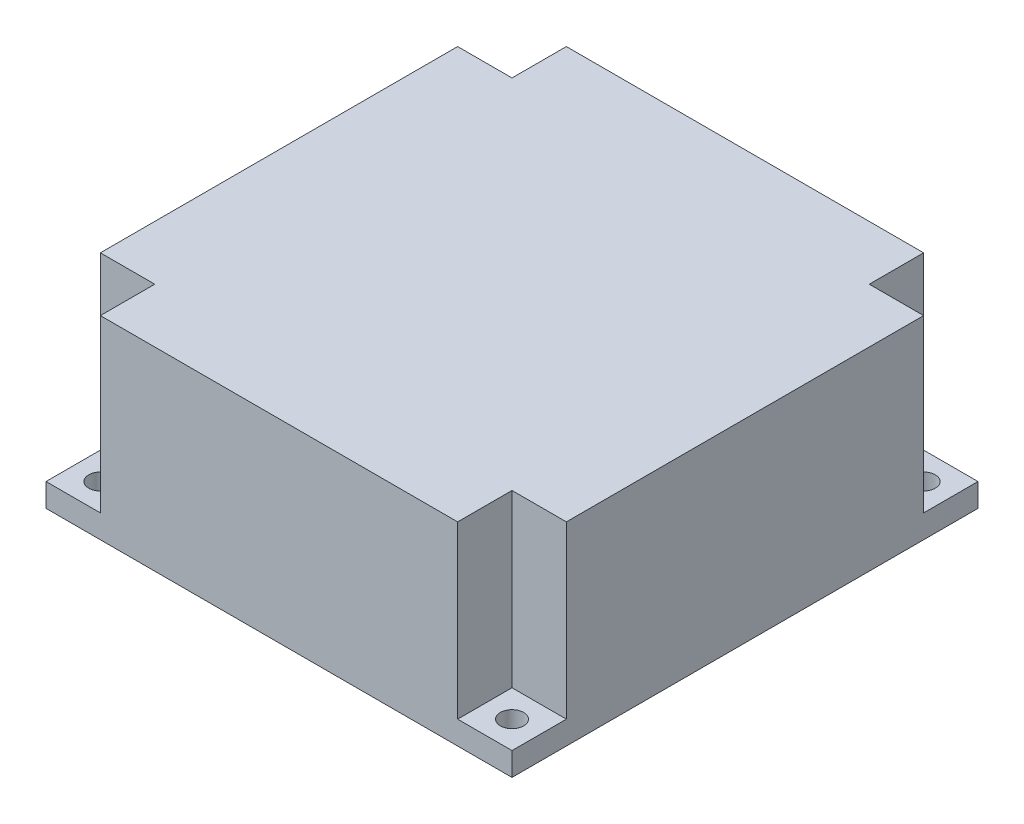
ISO-10303-21;
HEADER;
FILE_DESCRIPTION(('STEP AP214'),'2;1');
FILE_NAME('part.step','',(''),(''),'','','');
FILE_SCHEMA(('AUTOMOTIVE_DESIGN { 1 0 10303 214 1 1 1 1 }'));
ENDSEC;
DATA;
#1=APPLICATION_CONTEXT('core data for automotive mechanical design processes');
#2=APPLICATION_PROTOCOL_DEFINITION('international standard','automotive_design',2000,#1);
#3=PRODUCT_CONTEXT('',#1,'mechanical');
#4=PRODUCT('Part','Part','',(#3));
#5=PRODUCT_RELATED_PRODUCT_CATEGORY('part','',(#4));
#6=PRODUCT_DEFINITION_FORMATION('','',#4);
#7=PRODUCT_DEFINITION_CONTEXT('part definition',#1,'design');
#8=PRODUCT_DEFINITION('design','',#6,#7);
#9=PRODUCT_DEFINITION_SHAPE('','',#8);
#10=(LENGTH_UNIT() NAMED_UNIT(*) SI_UNIT(.MILLI.,.METRE.));
#11=(NAMED_UNIT(*) PLANE_ANGLE_UNIT() SI_UNIT($,.RADIAN.));
#12=(NAMED_UNIT(*) SI_UNIT($,.STERADIAN.) SOLID_ANGLE_UNIT());
#13=UNCERTAINTY_MEASURE_WITH_UNIT(LENGTH_MEASURE(1.E-05),#10,'distance_accuracy_value','');
#14=(GEOMETRIC_REPRESENTATION_CONTEXT(3) GLOBAL_UNCERTAINTY_ASSIGNED_CONTEXT((#13)) GLOBAL_UNIT_ASSIGNED_CONTEXT((#10,
#11,#12)) REPRESENTATION_CONTEXT('',''));
#15=CARTESIAN_POINT('',(0.,0.,0.));
#16=DIRECTION('',(0.,0.,1.));
#17=DIRECTION('',(1.,0.,0.));
#18=AXIS2_PLACEMENT_3D('',#15,#16,#17);
#19=CARTESIAN_POINT('',(0.,3.,0.));
#20=DIRECTION('',(0.,-1.,0.));
#21=DIRECTION('',(0.,0.,-1.));
#22=AXIS2_PLACEMENT_3D('',#19,#20,#21);
#23=PLANE('',#22);
#24=CARTESIAN_POINT('',(56.4999999999999,3.,-56.5));
#25=DIRECTION('',(0.,1.,0.));
#26=DIRECTION('',(0.,0.,1.));
#27=AXIS2_PLACEMENT_3D('',#24,#25,#26);
#28=CIRCLE('',#27,1.5);
#29=CARTESIAN_POINT('',(56.4999999999999,3.,-55.));
#30=VERTEX_POINT('',#29);
#31=EDGE_CURVE('E185',#30,#30,#28,.T.);
#32=ORIENTED_EDGE('',*,*,#31,.F.);
#33=EDGE_LOOP('',(#32));
#34=FACE_BOUND('',#33,.T.);
#35=DIRECTION('',(0.,0.,-1.));
#36=VECTOR('',#35,1.);
#37=CARTESIAN_POINT('',(53.,3.,-60.));
#38=LINE('',#37,#36);
#39=CARTESIAN_POINT('',(53.,3.,-53.));
#40=VERTEX_POINT('',#39);
#41=CARTESIAN_POINT('',(53.,3.,-60.));
#42=VERTEX_POINT('',#41);
#43=EDGE_CURVE('E49',#40,#42,#38,.T.);
#44=ORIENTED_EDGE('',*,*,#43,.F.);
#45=DIRECTION('',(-1.,0.,0.));
#46=VECTOR('',#45,1.);
#47=CARTESIAN_POINT('',(60.,3.,-53.));
#48=LINE('',#47,#46);
#49=CARTESIAN_POINT('',(60.,3.,-53.));
#50=VERTEX_POINT('',#49);
#51=EDGE_CURVE('E325',#50,#40,#48,.T.);
#52=ORIENTED_EDGE('',*,*,#51,.F.);
#53=DIRECTION('',(0.,0.,-1.));
#54=VECTOR('',#53,1.);
#55=CARTESIAN_POINT('',(60.,3.,0.));
#56=LINE('',#55,#54);
#57=CARTESIAN_POINT('',(60.,3.,-60.));
#58=VERTEX_POINT('',#57);
#59=EDGE_CURVE('E240',#50,#58,#56,.T.);
#60=ORIENTED_EDGE('',*,*,#59,.T.);
#61=DIRECTION('',(-1.,0.,0.));
#62=VECTOR('',#61,1.);
#63=CARTESIAN_POINT('',(0.,3.,-60.));
#64=LINE('',#63,#62);
#65=EDGE_CURVE('E223',#58,#42,#64,.T.);
#66=ORIENTED_EDGE('',*,*,#65,.T.);
#67=EDGE_LOOP('',(#44,#52,#60,#66));
#68=FACE_BOUND('',#67,.T.);
#69=ADVANCED_FACE('F32',(#34,#68),#23,.F.);
#70=CARTESIAN_POINT('',(56.5000000000001,3.,-3.5));
#71=DIRECTION('',(0.,1.,0.));
#72=DIRECTION('',(0.,0.,1.));
#73=AXIS2_PLACEMENT_3D('',#70,#71,#72);
#74=CIRCLE('',#73,1.5);
#75=CARTESIAN_POINT('',(56.5000000000001,3.,-2.));
#76=VERTEX_POINT('',#75);
#77=EDGE_CURVE('E191',#76,#76,#74,.T.);
#78=ORIENTED_EDGE('',*,*,#77,.F.);
#79=EDGE_LOOP('',(#78));
#80=FACE_BOUND('',#79,.T.);
#81=DIRECTION('',(1.,0.,0.));
#82=VECTOR('',#81,1.);
#83=CARTESIAN_POINT('',(60.,3.,-7.));
#84=LINE('',#83,#82);
#85=CARTESIAN_POINT('',(53.,3.,-7.));
#86=VERTEX_POINT('',#85);
#87=CARTESIAN_POINT('',(60.,3.,-7.));
#88=VERTEX_POINT('',#87);
#89=EDGE_CURVE('E57',#86,#88,#84,.T.);
#90=ORIENTED_EDGE('',*,*,#89,.F.);
#91=DIRECTION('',(0.,0.,-1.));
#92=VECTOR('',#91,1.);
#93=CARTESIAN_POINT('',(53.,3.,-7.));
#94=LINE('',#93,#92);
#95=CARTESIAN_POINT('',(53.,3.,0.));
#96=VERTEX_POINT('',#95);
#97=EDGE_CURVE('E263',#96,#86,#94,.T.);
#98=ORIENTED_EDGE('',*,*,#97,.F.);
#99=DIRECTION('',(1.,0.,0.));
#100=VECTOR('',#99,1.);
#101=CARTESIAN_POINT('',(0.,3.,0.));
#102=LINE('',#101,#100);
#103=CARTESIAN_POINT('',(60.,3.,0.));
#104=VERTEX_POINT('',#103);
#105=EDGE_CURVE('E213',#96,#104,#102,.T.);
#106=ORIENTED_EDGE('',*,*,#105,.T.);
#107=EDGE_CURVE('E242',#104,#88,#56,.T.);
#108=ORIENTED_EDGE('',*,*,#107,.T.);
#109=EDGE_LOOP('',(#90,#98,#106,#108));
#110=FACE_BOUND('',#109,.T.);
#111=ADVANCED_FACE('F380',(#80,#110),#23,.F.);
#112=CARTESIAN_POINT('',(3.50000000000009,3.,-3.5));
#113=DIRECTION('',(0.,1.,0.));
#114=DIRECTION('',(0.,0.,1.));
#115=AXIS2_PLACEMENT_3D('',#112,#113,#114);
#116=CIRCLE('',#115,1.5);
#117=CARTESIAN_POINT('',(3.50000000000009,3.,-2.));
#118=VERTEX_POINT('',#117);
#119=EDGE_CURVE('E197',#118,#118,#116,.T.);
#120=ORIENTED_EDGE('',*,*,#119,.F.);
#121=EDGE_LOOP('',(#120));
#122=FACE_BOUND('',#121,.T.);
#123=DIRECTION('',(0.,0.,1.));
#124=VECTOR('',#123,1.);
#125=CARTESIAN_POINT('',(7.00000000000001,3.,-6.99999999999999));
#126=LINE('',#125,#124);
#127=CARTESIAN_POINT('',(7.00000000000001,3.,-6.99999999999999));
#128=VERTEX_POINT('',#127);
#129=CARTESIAN_POINT('',(7.,3.,0.));
#130=VERTEX_POINT('',#129);
#131=EDGE_CURVE('E249',#128,#130,#126,.T.);
#132=ORIENTED_EDGE('',*,*,#131,.F.);
#133=DIRECTION('',(1.,0.,0.));
#134=VECTOR('',#133,1.);
#135=CARTESIAN_POINT('',(7.00000000000001,3.,-6.99999999999999));
#136=LINE('',#135,#134);
#137=CARTESIAN_POINT('',(0.,3.,-6.99999999999999));
#138=VERTEX_POINT('',#137);
#139=EDGE_CURVE('E264',#138,#128,#136,.T.);
#140=ORIENTED_EDGE('',*,*,#139,.F.);
#141=DIRECTION('',(0.,0.,1.));
#142=VECTOR('',#141,1.);
#143=CARTESIAN_POINT('',(0.,3.,0.));
#144=LINE('',#143,#142);
#145=CARTESIAN_POINT('',(0.,3.,0.));
#146=VERTEX_POINT('',#145);
#147=EDGE_CURVE('E209',#138,#146,#144,.T.);
#148=ORIENTED_EDGE('',*,*,#147,.T.);
#149=EDGE_CURVE('E243',#146,#130,#102,.T.);
#150=ORIENTED_EDGE('',*,*,#149,.T.);
#151=EDGE_LOOP('',(#132,#140,#148,#150));
#152=FACE_BOUND('',#151,.T.);
#153=ADVANCED_FACE('F248',(#122,#152),#23,.F.);
#154=CARTESIAN_POINT('',(3.49999999999991,3.,-56.5));
#155=DIRECTION('',(0.,1.,0.));
#156=DIRECTION('',(0.,0.,1.));
#157=AXIS2_PLACEMENT_3D('',#154,#155,#156);
#158=CIRCLE('',#157,1.5);
#159=CARTESIAN_POINT('',(3.49999999999991,3.,-55.));
#160=VERTEX_POINT('',#159);
#161=EDGE_CURVE('E174',#160,#160,#158,.T.);
#162=ORIENTED_EDGE('',*,*,#161,.F.);
#163=EDGE_LOOP('',(#162));
#164=FACE_BOUND('',#163,.T.);
#165=DIRECTION('',(0.,0.,1.));
#166=VECTOR('',#165,1.);
#167=CARTESIAN_POINT('',(7.,3.,-60.));
#168=LINE('',#167,#166);
#169=CARTESIAN_POINT('',(7.,3.,-60.));
#170=VERTEX_POINT('',#169);
#171=CARTESIAN_POINT('',(7.00000000000001,3.,-53.));
#172=VERTEX_POINT('',#171);
#173=EDGE_CURVE('E170',#170,#172,#168,.T.);
#174=ORIENTED_EDGE('',*,*,#173,.F.);
#175=CARTESIAN_POINT('',(0.,3.,-60.));
#176=VERTEX_POINT('',#175);
#177=EDGE_CURVE('E236',#170,#176,#64,.T.);
#178=ORIENTED_EDGE('',*,*,#177,.T.);
#179=CARTESIAN_POINT('',(0.,3.,-53.));
#180=VERTEX_POINT('',#179);
#181=EDGE_CURVE('E212',#176,#180,#144,.T.);
#182=ORIENTED_EDGE('',*,*,#181,.T.);
#183=DIRECTION('',(-1.,0.,0.));
#184=VECTOR('',#183,1.);
#185=CARTESIAN_POINT('',(7.00000000000001,3.,-53.));
#186=LINE('',#185,#184);
#187=EDGE_CURVE('E280',#172,#180,#186,.T.);
#188=ORIENTED_EDGE('',*,*,#187,.F.);
#189=EDGE_LOOP('',(#174,#178,#182,#188));
#190=FACE_BOUND('',#189,.T.);
#191=ADVANCED_FACE('F309',(#164,#190),#23,.F.);
#192=CARTESIAN_POINT('',(0.,0.,0.));
#193=DIRECTION('',(0.,-1.,0.));
#194=DIRECTION('',(0.,0.,-1.));
#195=AXIS2_PLACEMENT_3D('',#192,#193,#194);
#196=PLANE('',#195);
#197=CARTESIAN_POINT('',(56.4999999999999,0.,-56.5));
#198=DIRECTION('',(0.,1.,0.));
#199=DIRECTION('',(0.,0.,1.));
#200=AXIS2_PLACEMENT_3D('',#197,#198,#199);
#201=CIRCLE('',#200,1.5);
#202=CARTESIAN_POINT('',(56.4999999999999,0.,-55.));
#203=VERTEX_POINT('',#202);
#204=EDGE_CURVE('E183',#203,#203,#201,.T.);
#205=ORIENTED_EDGE('',*,*,#204,.T.);
#206=EDGE_LOOP('',(#205));
#207=FACE_BOUND('',#206,.T.);
#208=CARTESIAN_POINT('',(3.50000000000009,0.,-3.5));
#209=DIRECTION('',(0.,1.,0.));
#210=DIRECTION('',(0.,0.,1.));
#211=AXIS2_PLACEMENT_3D('',#208,#209,#210);
#212=CIRCLE('',#211,1.5);
#213=CARTESIAN_POINT('',(3.50000000000009,0.,-2.));
#214=VERTEX_POINT('',#213);
#215=EDGE_CURVE('E194',#214,#214,#212,.T.);
#216=ORIENTED_EDGE('',*,*,#215,.T.);
#217=EDGE_LOOP('',(#216));
#218=FACE_BOUND('',#217,.T.);
#219=DIRECTION('',(0.,0.,1.));
#220=VECTOR('',#219,1.);
#221=CARTESIAN_POINT('',(0.,0.,0.));
#222=LINE('',#221,#220);
#223=CARTESIAN_POINT('',(0.,0.,-60.));
#224=VERTEX_POINT('',#223);
#225=CARTESIAN_POINT('',(0.,0.,0.));
#226=VERTEX_POINT('',#225);
#227=EDGE_CURVE('E200',#224,#226,#222,.T.);
#228=ORIENTED_EDGE('',*,*,#227,.F.);
#229=DIRECTION('',(-1.,0.,0.));
#230=VECTOR('',#229,1.);
#231=CARTESIAN_POINT('',(0.,0.,-60.));
#232=LINE('',#231,#230);
#233=CARTESIAN_POINT('',(60.,0.,-60.));
#234=VERTEX_POINT('',#233);
#235=EDGE_CURVE('E224',#234,#224,#232,.T.);
#236=ORIENTED_EDGE('',*,*,#235,.F.);
#237=DIRECTION('',(0.,0.,-1.));
#238=VECTOR('',#237,1.);
#239=CARTESIAN_POINT('',(60.,0.,0.));
#240=LINE('',#239,#238);
#241=CARTESIAN_POINT('',(60.,0.,0.));
#242=VERTEX_POINT('',#241);
#243=EDGE_CURVE('E226',#242,#234,#240,.T.);
#244=ORIENTED_EDGE('',*,*,#243,.F.);
#245=DIRECTION('',(1.,0.,0.));
#246=VECTOR('',#245,1.);
#247=CARTESIAN_POINT('',(0.,0.,0.));
#248=LINE('',#247,#246);
#249=EDGE_CURVE('E228',#226,#242,#248,.T.);
#250=ORIENTED_EDGE('',*,*,#249,.F.);
#251=EDGE_LOOP('',(#228,#236,#244,#250));
#252=FACE_BOUND('',#251,.T.);
#253=CARTESIAN_POINT('',(56.5000000000001,0.,-3.5));
#254=DIRECTION('',(0.,1.,0.));
#255=DIRECTION('',(0.,0.,1.));
#256=AXIS2_PLACEMENT_3D('',#253,#254,#255);
#257=CIRCLE('',#256,1.5);
#258=CARTESIAN_POINT('',(56.5000000000001,0.,-2.));
#259=VERTEX_POINT('',#258);
#260=EDGE_CURVE('E188',#259,#259,#257,.T.);
#261=ORIENTED_EDGE('',*,*,#260,.T.);
#262=EDGE_LOOP('',(#261));
#263=FACE_BOUND('',#262,.T.);
#264=CARTESIAN_POINT('',(3.49999999999991,0.,-56.5));
#265=DIRECTION('',(0.,1.,0.));
#266=DIRECTION('',(0.,0.,1.));
#267=AXIS2_PLACEMENT_3D('',#264,#265,#266);
#268=CIRCLE('',#267,1.5);
#269=CARTESIAN_POINT('',(3.49999999999991,0.,-55.));
#270=VERTEX_POINT('',#269);
#271=EDGE_CURVE('E171',#270,#270,#268,.T.);
#272=ORIENTED_EDGE('',*,*,#271,.T.);
#273=EDGE_LOOP('',(#272));
#274=FACE_BOUND('',#273,.T.);
#275=ADVANCED_FACE('F300',(#207,#218,#252,#263,#274),#196,.T.);
#276=CARTESIAN_POINT('',(0.,3.,0.));
#277=DIRECTION('',(1.,0.,0.));
#278=DIRECTION('',(0.,0.,-1.));
#279=AXIS2_PLACEMENT_3D('',#276,#277,#278);
#280=PLANE('',#279);
#281=ORIENTED_EDGE('',*,*,#227,.T.);
#282=DIRECTION('',(0.,-1.,0.));
#283=VECTOR('',#282,1.);
#284=CARTESIAN_POINT('',(0.,3.,0.));
#285=LINE('',#284,#283);
#286=EDGE_CURVE('E11',#146,#226,#285,.T.);
#287=ORIENTED_EDGE('',*,*,#286,.F.);
#288=ORIENTED_EDGE('',*,*,#147,.F.);
#289=DIRECTION('',(0.,-1.,0.));
#290=VECTOR('',#289,1.);
#291=CARTESIAN_POINT('',(0.,25.,-6.99999999999999));
#292=LINE('',#291,#290);
#293=CARTESIAN_POINT('',(0.,25.,-6.99999999999999));
#294=VERTEX_POINT('',#293);
#295=EDGE_CURVE('E176',#294,#138,#292,.T.);
#296=ORIENTED_EDGE('',*,*,#295,.F.);
#297=DIRECTION('',(0.,0.,1.));
#298=VECTOR('',#297,1.);
#299=CARTESIAN_POINT('',(0.,25.,-53.));
#300=LINE('',#299,#298);
#301=CARTESIAN_POINT('',(0.,25.,-53.));
#302=VERTEX_POINT('',#301);
#303=EDGE_CURVE('E158',#302,#294,#300,.T.);
#304=ORIENTED_EDGE('',*,*,#303,.F.);
#305=DIRECTION('',(0.,-1.,0.));
#306=VECTOR('',#305,1.);
#307=CARTESIAN_POINT('',(0.,25.,-53.));
#308=LINE('',#307,#306);
#309=EDGE_CURVE('E155',#302,#180,#308,.T.);
#310=ORIENTED_EDGE('',*,*,#309,.T.);
#311=ORIENTED_EDGE('',*,*,#181,.F.);
#312=DIRECTION('',(0.,-1.,0.));
#313=VECTOR('',#312,1.);
#314=CARTESIAN_POINT('',(0.,3.,-60.));
#315=LINE('',#314,#313);
#316=EDGE_CURVE('E220',#176,#224,#315,.T.);
#317=ORIENTED_EDGE('',*,*,#316,.T.);
#318=EDGE_LOOP('',(#281,#287,#288,#296,#304,#310,#311,#317));
#319=FACE_BOUND('',#318,.T.);
#320=ADVANCED_FACE('F34',(#319),#280,.F.);
#321=CARTESIAN_POINT('',(0.,3.,0.));
#322=DIRECTION('',(0.,0.,-1.));
#323=DIRECTION('',(-1.,0.,0.));
#324=AXIS2_PLACEMENT_3D('',#321,#322,#323);
#325=PLANE('',#324);
#326=ORIENTED_EDGE('',*,*,#249,.T.);
#327=DIRECTION('',(0.,-1.,0.));
#328=VECTOR('',#327,1.);
#329=CARTESIAN_POINT('',(60.,3.,0.));
#330=LINE('',#329,#328);
#331=EDGE_CURVE('E41',#104,#242,#330,.T.);
#332=ORIENTED_EDGE('',*,*,#331,.F.);
#333=ORIENTED_EDGE('',*,*,#105,.F.);
#334=DIRECTION('',(0.,-1.,0.));
#335=VECTOR('',#334,1.);
#336=CARTESIAN_POINT('',(53.,25.,0.));
#337=LINE('',#336,#335);
#338=CARTESIAN_POINT('',(53.,25.,0.));
#339=VERTEX_POINT('',#338);
#340=EDGE_CURVE('E269',#339,#96,#337,.T.);
#341=ORIENTED_EDGE('',*,*,#340,.F.);
#342=DIRECTION('',(1.,0.,0.));
#343=VECTOR('',#342,1.);
#344=CARTESIAN_POINT('',(7.00000000000001,25.,0.));
#345=LINE('',#344,#343);
#346=CARTESIAN_POINT('',(7.00000000000001,25.,0.));
#347=VERTEX_POINT('',#346);
#348=EDGE_CURVE('E268',#347,#339,#345,.T.);
#349=ORIENTED_EDGE('',*,*,#348,.F.);
#350=DIRECTION('',(0.,-1.,0.));
#351=VECTOR('',#350,1.);
#352=CARTESIAN_POINT('',(7.00000000000001,25.,0.));
#353=LINE('',#352,#351);
#354=EDGE_CURVE('E260',#347,#130,#353,.T.);
#355=ORIENTED_EDGE('',*,*,#354,.T.);
#356=ORIENTED_EDGE('',*,*,#149,.F.);
#357=ORIENTED_EDGE('',*,*,#286,.T.);
#358=EDGE_LOOP('',(#326,#332,#333,#341,#349,#355,#356,#357));
#359=FACE_BOUND('',#358,.T.);
#360=ADVANCED_FACE('F266',(#359),#325,.F.);
#361=CARTESIAN_POINT('',(60.,3.,0.));
#362=DIRECTION('',(-1.,0.,0.));
#363=DIRECTION('',(0.,0.,1.));
#364=AXIS2_PLACEMENT_3D('',#361,#362,#363);
#365=PLANE('',#364);
#366=ORIENTED_EDGE('',*,*,#243,.T.);
#367=DIRECTION('',(0.,-1.,0.));
#368=VECTOR('',#367,1.);
#369=CARTESIAN_POINT('',(60.,3.,-60.));
#370=LINE('',#369,#368);
#371=EDGE_CURVE('E217',#58,#234,#370,.T.);
#372=ORIENTED_EDGE('',*,*,#371,.F.);
#373=ORIENTED_EDGE('',*,*,#59,.F.);
#374=DIRECTION('',(0.,-1.,0.));
#375=VECTOR('',#374,1.);
#376=CARTESIAN_POINT('',(60.,25.,-53.));
#377=LINE('',#376,#375);
#378=CARTESIAN_POINT('',(60.,25.,-53.));
#379=VERTEX_POINT('',#378);
#380=EDGE_CURVE('E330',#379,#50,#377,.T.);
#381=ORIENTED_EDGE('',*,*,#380,.F.);
#382=DIRECTION('',(0.,0.,-1.));
#383=VECTOR('',#382,1.);
#384=CARTESIAN_POINT('',(60.,25.,-53.));
#385=LINE('',#384,#383);
#386=CARTESIAN_POINT('',(60.,25.,-7.));
#387=VERTEX_POINT('',#386);
#388=EDGE_CURVE('E369',#387,#379,#385,.T.);
#389=ORIENTED_EDGE('',*,*,#388,.F.);
#390=DIRECTION('',(0.,-1.,0.));
#391=VECTOR('',#390,1.);
#392=CARTESIAN_POINT('',(60.,25.,-7.));
#393=LINE('',#392,#391);
#394=EDGE_CURVE('E328',#387,#88,#393,.T.);
#395=ORIENTED_EDGE('',*,*,#394,.T.);
#396=ORIENTED_EDGE('',*,*,#107,.F.);
#397=ORIENTED_EDGE('',*,*,#331,.T.);
#398=EDGE_LOOP('',(#366,#372,#373,#381,#389,#395,#396,#397));
#399=FACE_BOUND('',#398,.T.);
#400=ADVANCED_FACE('F296',(#399),#365,.F.);
#401=CARTESIAN_POINT('',(0.,3.,-60.));
#402=DIRECTION('',(0.,0.,1.));
#403=DIRECTION('',(1.,0.,0.));
#404=AXIS2_PLACEMENT_3D('',#401,#402,#403);
#405=PLANE('',#404);
#406=ORIENTED_EDGE('',*,*,#235,.T.);
#407=ORIENTED_EDGE('',*,*,#316,.F.);
#408=ORIENTED_EDGE('',*,*,#177,.F.);
#409=DIRECTION('',(0.,-1.,0.));
#410=VECTOR('',#409,1.);
#411=CARTESIAN_POINT('',(7.,25.,-60.));
#412=LINE('',#411,#410);
#413=CARTESIAN_POINT('',(7.,25.,-60.));
#414=VERTEX_POINT('',#413);
#415=EDGE_CURVE('E354',#414,#170,#412,.T.);
#416=ORIENTED_EDGE('',*,*,#415,.F.);
#417=DIRECTION('',(-1.,0.,0.));
#418=VECTOR('',#417,1.);
#419=CARTESIAN_POINT('',(7.,25.,-60.));
#420=LINE('',#419,#418);
#421=CARTESIAN_POINT('',(53.,25.,-60.));
#422=VERTEX_POINT('',#421);
#423=EDGE_CURVE('E164',#422,#414,#420,.T.);
#424=ORIENTED_EDGE('',*,*,#423,.F.);
#425=DIRECTION('',(0.,-1.,0.));
#426=VECTOR('',#425,1.);
#427=CARTESIAN_POINT('',(53.,25.,-60.));
#428=LINE('',#427,#426);
#429=EDGE_CURVE('E348',#422,#42,#428,.T.);
#430=ORIENTED_EDGE('',*,*,#429,.T.);
#431=ORIENTED_EDGE('',*,*,#65,.F.);
#432=ORIENTED_EDGE('',*,*,#371,.T.);
#433=EDGE_LOOP('',(#406,#407,#408,#416,#424,#430,#431,#432));
#434=FACE_BOUND('',#433,.T.);
#435=ADVANCED_FACE('F304',(#434),#405,.F.);
#436=CARTESIAN_POINT('',(3.50000000000009,3.,-3.5));
#437=DIRECTION('',(0.,-1.,0.));
#438=DIRECTION('',(0.,0.,-1.));
#439=AXIS2_PLACEMENT_3D('',#436,#437,#438);
#440=CYLINDRICAL_SURFACE('',#439,1.5);
#441=ORIENTED_EDGE('',*,*,#119,.T.);
#442=EDGE_LOOP('',(#441));
#443=FACE_BOUND('',#442,.T.);
#444=ORIENTED_EDGE('',*,*,#215,.F.);
#445=EDGE_LOOP('',(#444));
#446=FACE_BOUND('',#445,.T.);
#447=ADVANCED_FACE('F393',(#443,#446),#440,.F.);
#448=CARTESIAN_POINT('',(56.5000000000001,3.,-3.5));
#449=DIRECTION('',(0.,-1.,0.));
#450=DIRECTION('',(0.,0.,-1.));
#451=AXIS2_PLACEMENT_3D('',#448,#449,#450);
#452=CYLINDRICAL_SURFACE('',#451,1.5);
#453=ORIENTED_EDGE('',*,*,#77,.T.);
#454=EDGE_LOOP('',(#453));
#455=FACE_BOUND('',#454,.T.);
#456=ORIENTED_EDGE('',*,*,#260,.F.);
#457=EDGE_LOOP('',(#456));
#458=FACE_BOUND('',#457,.T.);
#459=ADVANCED_FACE('F443',(#455,#458),#452,.F.);
#460=CARTESIAN_POINT('',(56.4999999999999,3.,-56.5));
#461=DIRECTION('',(0.,-1.,0.));
#462=DIRECTION('',(0.,0.,-1.));
#463=AXIS2_PLACEMENT_3D('',#460,#461,#462);
#464=CYLINDRICAL_SURFACE('',#463,1.5);
#465=ORIENTED_EDGE('',*,*,#31,.T.);
#466=EDGE_LOOP('',(#465));
#467=FACE_BOUND('',#466,.T.);
#468=ORIENTED_EDGE('',*,*,#204,.F.);
#469=EDGE_LOOP('',(#468));
#470=FACE_BOUND('',#469,.T.);
#471=ADVANCED_FACE('F436',(#467,#470),#464,.F.);
#472=CARTESIAN_POINT('',(3.49999999999991,3.,-56.5));
#473=DIRECTION('',(0.,-1.,0.));
#474=DIRECTION('',(0.,0.,-1.));
#475=AXIS2_PLACEMENT_3D('',#472,#473,#474);
#476=CYLINDRICAL_SURFACE('',#475,1.5);
#477=ORIENTED_EDGE('',*,*,#161,.T.);
#478=EDGE_LOOP('',(#477));
#479=FACE_BOUND('',#478,.T.);
#480=ORIENTED_EDGE('',*,*,#271,.F.);
#481=EDGE_LOOP('',(#480));
#482=FACE_BOUND('',#481,.T.);
#483=ADVANCED_FACE('F432',(#479,#482),#476,.F.);
#484=CARTESIAN_POINT('',(7.,25.,-60.));
#485=DIRECTION('',(1.,0.,0.));
#486=DIRECTION('',(0.,0.,-1.));
#487=AXIS2_PLACEMENT_3D('',#484,#485,#486);
#488=PLANE('',#487);
#489=ORIENTED_EDGE('',*,*,#173,.T.);
#490=DIRECTION('',(0.,-1.,0.));
#491=VECTOR('',#490,1.);
#492=CARTESIAN_POINT('',(7.00000000000001,25.,-53.));
#493=LINE('',#492,#491);
#494=CARTESIAN_POINT('',(7.00000000000001,25.,-53.));
#495=VERTEX_POINT('',#494);
#496=EDGE_CURVE('E152',#495,#172,#493,.T.);
#497=ORIENTED_EDGE('',*,*,#496,.F.);
#498=DIRECTION('',(0.,0.,1.));
#499=VECTOR('',#498,1.);
#500=CARTESIAN_POINT('',(7.,25.,-60.));
#501=LINE('',#500,#499);
#502=EDGE_CURVE('E159',#414,#495,#501,.T.);
#503=ORIENTED_EDGE('',*,*,#502,.F.);
#504=ORIENTED_EDGE('',*,*,#415,.T.);
#505=EDGE_LOOP('',(#489,#497,#503,#504));
#506=FACE_BOUND('',#505,.T.);
#507=ADVANCED_FACE('F169',(#506),#488,.F.);
#508=CARTESIAN_POINT('',(7.00000000000001,25.,-53.));
#509=DIRECTION('',(0.,0.,1.));
#510=DIRECTION('',(1.,0.,0.));
#511=AXIS2_PLACEMENT_3D('',#508,#509,#510);
#512=PLANE('',#511);
#513=ORIENTED_EDGE('',*,*,#187,.T.);
#514=ORIENTED_EDGE('',*,*,#309,.F.);
#515=DIRECTION('',(-1.,0.,0.));
#516=VECTOR('',#515,1.);
#517=CARTESIAN_POINT('',(7.00000000000001,25.,-53.));
#518=LINE('',#517,#516);
#519=EDGE_CURVE('E147',#495,#302,#518,.T.);
#520=ORIENTED_EDGE('',*,*,#519,.F.);
#521=ORIENTED_EDGE('',*,*,#496,.T.);
#522=EDGE_LOOP('',(#513,#514,#520,#521));
#523=FACE_BOUND('',#522,.T.);
#524=ADVANCED_FACE('F150',(#523),#512,.F.);
#525=CARTESIAN_POINT('',(7.00000000000001,25.,-6.99999999999999));
#526=DIRECTION('',(0.,0.,-1.));
#527=DIRECTION('',(-1.,0.,0.));
#528=AXIS2_PLACEMENT_3D('',#525,#526,#527);
#529=PLANE('',#528);
#530=ORIENTED_EDGE('',*,*,#139,.T.);
#531=DIRECTION('',(0.,-1.,0.));
#532=VECTOR('',#531,1.);
#533=CARTESIAN_POINT('',(7.00000000000001,25.,-6.99999999999999));
#534=LINE('',#533,#532);
#535=CARTESIAN_POINT('',(7.00000000000001,25.,-6.99999999999999));
#536=VERTEX_POINT('',#535);
#537=EDGE_CURVE('E180',#536,#128,#534,.T.);
#538=ORIENTED_EDGE('',*,*,#537,.F.);
#539=DIRECTION('',(1.,0.,0.));
#540=VECTOR('',#539,1.);
#541=CARTESIAN_POINT('',(7.00000000000001,25.,-6.99999999999999));
#542=LINE('',#541,#540);
#543=EDGE_CURVE('E287',#294,#536,#542,.T.);
#544=ORIENTED_EDGE('',*,*,#543,.F.);
#545=ORIENTED_EDGE('',*,*,#295,.T.);
#546=EDGE_LOOP('',(#530,#538,#544,#545));
#547=FACE_BOUND('',#546,.T.);
#548=ADVANCED_FACE('F286',(#547),#529,.F.);
#549=CARTESIAN_POINT('',(7.00000000000001,25.,-6.99999999999999));
#550=DIRECTION('',(1.,0.,0.));
#551=DIRECTION('',(0.,0.,-1.));
#552=AXIS2_PLACEMENT_3D('',#549,#550,#551);
#553=PLANE('',#552);
#554=ORIENTED_EDGE('',*,*,#131,.T.);
#555=ORIENTED_EDGE('',*,*,#354,.F.);
#556=DIRECTION('',(0.,0.,1.));
#557=VECTOR('',#556,1.);
#558=CARTESIAN_POINT('',(7.00000000000001,25.,-6.99999999999999));
#559=LINE('',#558,#557);
#560=EDGE_CURVE('E377',#536,#347,#559,.T.);
#561=ORIENTED_EDGE('',*,*,#560,.F.);
#562=ORIENTED_EDGE('',*,*,#537,.T.);
#563=EDGE_LOOP('',(#554,#555,#561,#562));
#564=FACE_BOUND('',#563,.T.);
#565=ADVANCED_FACE('F258',(#564),#553,.F.);
#566=CARTESIAN_POINT('',(53.,25.,-7.));
#567=DIRECTION('',(-1.,0.,0.));
#568=DIRECTION('',(0.,0.,1.));
#569=AXIS2_PLACEMENT_3D('',#566,#567,#568);
#570=PLANE('',#569);
#571=ORIENTED_EDGE('',*,*,#97,.T.);
#572=DIRECTION('',(0.,-1.,0.));
#573=VECTOR('',#572,1.);
#574=CARTESIAN_POINT('',(53.,25.,-7.));
#575=LINE('',#574,#573);
#576=CARTESIAN_POINT('',(53.,25.,-7.));
#577=VERTEX_POINT('',#576);
#578=EDGE_CURVE('E272',#577,#86,#575,.T.);
#579=ORIENTED_EDGE('',*,*,#578,.F.);
#580=DIRECTION('',(0.,0.,-1.));
#581=VECTOR('',#580,1.);
#582=CARTESIAN_POINT('',(53.,25.,-7.));
#583=LINE('',#582,#581);
#584=EDGE_CURVE('E374',#339,#577,#583,.T.);
#585=ORIENTED_EDGE('',*,*,#584,.F.);
#586=ORIENTED_EDGE('',*,*,#340,.T.);
#587=EDGE_LOOP('',(#571,#579,#585,#586));
#588=FACE_BOUND('',#587,.T.);
#589=ADVANCED_FACE('F339',(#588),#570,.F.);
#590=CARTESIAN_POINT('',(60.,25.,-7.));
#591=DIRECTION('',(0.,0.,-1.));
#592=DIRECTION('',(-1.,0.,0.));
#593=AXIS2_PLACEMENT_3D('',#590,#591,#592);
#594=PLANE('',#593);
#595=ORIENTED_EDGE('',*,*,#89,.T.);
#596=ORIENTED_EDGE('',*,*,#394,.F.);
#597=DIRECTION('',(1.,0.,0.));
#598=VECTOR('',#597,1.);
#599=CARTESIAN_POINT('',(60.,25.,-7.));
#600=LINE('',#599,#598);
#601=EDGE_CURVE('E345',#577,#387,#600,.T.);
#602=ORIENTED_EDGE('',*,*,#601,.F.);
#603=ORIENTED_EDGE('',*,*,#578,.T.);
#604=EDGE_LOOP('',(#595,#596,#602,#603));
#605=FACE_BOUND('',#604,.T.);
#606=ADVANCED_FACE('F343',(#605),#594,.F.);
#607=CARTESIAN_POINT('',(60.,25.,-53.));
#608=DIRECTION('',(0.,0.,1.));
#609=DIRECTION('',(1.,0.,0.));
#610=AXIS2_PLACEMENT_3D('',#607,#608,#609);
#611=PLANE('',#610);
#612=ORIENTED_EDGE('',*,*,#51,.T.);
#613=DIRECTION('',(0.,-1.,0.));
#614=VECTOR('',#613,1.);
#615=CARTESIAN_POINT('',(53.,25.,-53.));
#616=LINE('',#615,#614);
#617=CARTESIAN_POINT('',(53.,25.,-53.));
#618=VERTEX_POINT('',#617);
#619=EDGE_CURVE('E346',#618,#40,#616,.T.);
#620=ORIENTED_EDGE('',*,*,#619,.F.);
#621=DIRECTION('',(-1.,0.,0.));
#622=VECTOR('',#621,1.);
#623=CARTESIAN_POINT('',(60.,25.,-53.));
#624=LINE('',#623,#622);
#625=EDGE_CURVE('E368',#379,#618,#624,.T.);
#626=ORIENTED_EDGE('',*,*,#625,.F.);
#627=ORIENTED_EDGE('',*,*,#380,.T.);
#628=EDGE_LOOP('',(#612,#620,#626,#627));
#629=FACE_BOUND('',#628,.T.);
#630=ADVANCED_FACE('F540',(#629),#611,.F.);
#631=CARTESIAN_POINT('',(53.,25.,-60.));
#632=DIRECTION('',(-1.,0.,0.));
#633=DIRECTION('',(0.,0.,1.));
#634=AXIS2_PLACEMENT_3D('',#631,#632,#633);
#635=PLANE('',#634);
#636=ORIENTED_EDGE('',*,*,#43,.T.);
#637=ORIENTED_EDGE('',*,*,#429,.F.);
#638=DIRECTION('',(0.,0.,-1.));
#639=VECTOR('',#638,1.);
#640=CARTESIAN_POINT('',(53.,25.,-60.));
#641=LINE('',#640,#639);
#642=EDGE_CURVE('E367',#618,#422,#641,.T.);
#643=ORIENTED_EDGE('',*,*,#642,.F.);
#644=ORIENTED_EDGE('',*,*,#619,.T.);
#645=EDGE_LOOP('',(#636,#637,#643,#644));
#646=FACE_BOUND('',#645,.T.);
#647=ADVANCED_FACE('F366',(#646),#635,.F.);
#648=CARTESIAN_POINT('',(0.,25.,0.));
#649=DIRECTION('',(0.,-1.,0.));
#650=DIRECTION('',(0.,0.,-1.));
#651=AXIS2_PLACEMENT_3D('',#648,#649,#650);
#652=PLANE('',#651);
#653=ORIENTED_EDGE('',*,*,#502,.T.);
#654=ORIENTED_EDGE('',*,*,#519,.T.);
#655=ORIENTED_EDGE('',*,*,#303,.T.);
#656=ORIENTED_EDGE('',*,*,#543,.T.);
#657=ORIENTED_EDGE('',*,*,#560,.T.);
#658=ORIENTED_EDGE('',*,*,#348,.T.);
#659=ORIENTED_EDGE('',*,*,#584,.T.);
#660=ORIENTED_EDGE('',*,*,#601,.T.);
#661=ORIENTED_EDGE('',*,*,#388,.T.);
#662=ORIENTED_EDGE('',*,*,#625,.T.);
#663=ORIENTED_EDGE('',*,*,#642,.T.);
#664=ORIENTED_EDGE('',*,*,#423,.T.);
#665=EDGE_LOOP('',(#653,#654,#655,#656,#657,#658,#659,#660,#661,#662,#663,#664));
#666=FACE_BOUND('',#665,.T.);
#667=ADVANCED_FACE('F162',(#666),#652,.F.);
#668=CLOSED_SHELL('',(#69,#111,#153,#191,#275,#320,#360,#400,#435,#447,#459,#471,#483,#507,#524,
#548,#565,#589,#606,#630,#647,#667));
#669=MANIFOLD_SOLID_BREP('B2',#668);
#670=ADVANCED_BREP_SHAPE_REPRESENTATION('',(#18,#669),#14);
#671=SHAPE_DEFINITION_REPRESENTATION(#9,#670);
ENDSEC;
END-ISO-10303-21;
